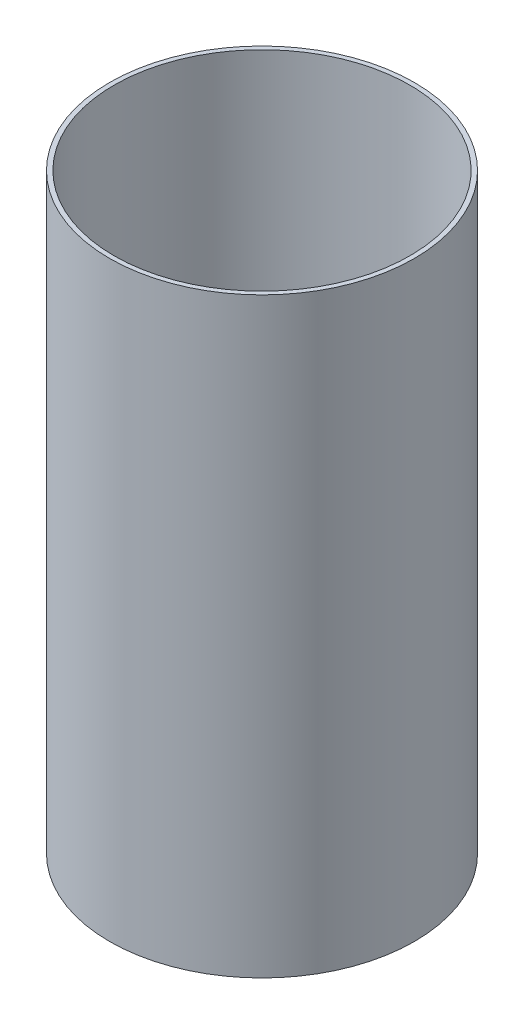
ISO-10303-21;
HEADER;
FILE_DESCRIPTION(('STEP AP214'),'2;1');
FILE_NAME('part.step','',(''),(''),'','','');
FILE_SCHEMA(('AUTOMOTIVE_DESIGN { 1 0 10303 214 1 1 1 1 }'));
ENDSEC;
DATA;
#1=APPLICATION_CONTEXT('core data for automotive mechanical design processes');
#2=APPLICATION_PROTOCOL_DEFINITION('international standard','automotive_design',2000,#1);
#3=PRODUCT_CONTEXT('',#1,'mechanical');
#4=PRODUCT('Part','Part','',(#3));
#5=PRODUCT_RELATED_PRODUCT_CATEGORY('part','',(#4));
#6=PRODUCT_DEFINITION_FORMATION('','',#4);
#7=PRODUCT_DEFINITION_CONTEXT('part definition',#1,'design');
#8=PRODUCT_DEFINITION('design','',#6,#7);
#9=PRODUCT_DEFINITION_SHAPE('','',#8);
#10=(LENGTH_UNIT() NAMED_UNIT(*) SI_UNIT(.MILLI.,.METRE.));
#11=(NAMED_UNIT(*) PLANE_ANGLE_UNIT() SI_UNIT($,.RADIAN.));
#12=(NAMED_UNIT(*) SI_UNIT($,.STERADIAN.) SOLID_ANGLE_UNIT());
#13=UNCERTAINTY_MEASURE_WITH_UNIT(LENGTH_MEASURE(1.E-05),#10,'distance_accuracy_value','');
#14=(GEOMETRIC_REPRESENTATION_CONTEXT(3) GLOBAL_UNCERTAINTY_ASSIGNED_CONTEXT((#13)) GLOBAL_UNIT_ASSIGNED_CONTEXT((#10,
#11,#12)) REPRESENTATION_CONTEXT('',''));
#15=CARTESIAN_POINT('',(0.,0.,0.));
#16=DIRECTION('',(0.,0.,1.));
#17=DIRECTION('',(1.,0.,0.));
#18=AXIS2_PLACEMENT_3D('',#15,#16,#17);
#19=CARTESIAN_POINT('',(0.,254.,0.));
#20=DIRECTION('',(0.,1.,0.));
#21=DIRECTION('',(0.,0.,1.));
#22=AXIS2_PLACEMENT_3D('',#19,#20,#21);
#23=PLANE('',#22);
#24=CARTESIAN_POINT('',(0.,254.,0.));
#25=DIRECTION('',(0.,1.,0.));
#26=DIRECTION('',(0.,0.,1.));
#27=AXIS2_PLACEMENT_3D('',#24,#25,#26);
#28=CIRCLE('',#27,65.4431);
#29=CARTESIAN_POINT('',(0.,254.,65.4431));
#30=VERTEX_POINT('',#29);
#31=EDGE_CURVE('E10',#30,#30,#28,.T.);
#32=ORIENTED_EDGE('',*,*,#31,.T.);
#33=EDGE_LOOP('',(#32));
#34=FACE_BOUND('',#33,.T.);
#35=CARTESIAN_POINT('',(0.,254.,0.));
#36=DIRECTION('',(0.,1.,0.));
#37=DIRECTION('',(0.,0.,1.));
#38=AXIS2_PLACEMENT_3D('',#35,#36,#37);
#39=CIRCLE('',#38,63.5);
#40=CARTESIAN_POINT('',(0.,254.,63.5));
#41=VERTEX_POINT('',#40);
#42=EDGE_CURVE('E41',#41,#41,#39,.T.);
#43=ORIENTED_EDGE('',*,*,#42,.F.);
#44=EDGE_LOOP('',(#43));
#45=FACE_BOUND('',#44,.T.);
#46=ADVANCED_FACE('F30',(#34,#45),#23,.T.);
#47=CARTESIAN_POINT('',(0.,0.,0.));
#48=DIRECTION('',(0.,1.,0.));
#49=DIRECTION('',(0.,0.,1.));
#50=AXIS2_PLACEMENT_3D('',#47,#48,#49);
#51=PLANE('',#50);
#52=CARTESIAN_POINT('',(0.,0.,0.));
#53=DIRECTION('',(0.,1.,0.));
#54=DIRECTION('',(0.,0.,1.));
#55=AXIS2_PLACEMENT_3D('',#52,#53,#54);
#56=CIRCLE('',#55,65.4431);
#57=CARTESIAN_POINT('',(0.,0.,65.4431));
#58=VERTEX_POINT('',#57);
#59=EDGE_CURVE('E34',#58,#58,#56,.T.);
#60=ORIENTED_EDGE('',*,*,#59,.F.);
#61=EDGE_LOOP('',(#60));
#62=FACE_BOUND('',#61,.T.);
#63=CARTESIAN_POINT('',(0.,0.,0.));
#64=DIRECTION('',(0.,1.,0.));
#65=DIRECTION('',(0.,0.,1.));
#66=AXIS2_PLACEMENT_3D('',#63,#64,#65);
#67=CIRCLE('',#66,63.5);
#68=CARTESIAN_POINT('',(0.,0.,63.5));
#69=VERTEX_POINT('',#68);
#70=EDGE_CURVE('E43',#69,#69,#67,.T.);
#71=ORIENTED_EDGE('',*,*,#70,.T.);
#72=EDGE_LOOP('',(#71));
#73=FACE_BOUND('',#72,.T.);
#74=ADVANCED_FACE('F53',(#62,#73),#51,.F.);
#75=CARTESIAN_POINT('',(0.,254.,0.));
#76=DIRECTION('',(0.,-1.,0.));
#77=DIRECTION('',(0.,0.,-1.));
#78=AXIS2_PLACEMENT_3D('',#75,#76,#77);
#79=CYLINDRICAL_SURFACE('',#78,65.4431);
#80=ORIENTED_EDGE('',*,*,#31,.F.);
#81=EDGE_LOOP('',(#80));
#82=FACE_BOUND('',#81,.T.);
#83=ORIENTED_EDGE('',*,*,#59,.T.);
#84=EDGE_LOOP('',(#83));
#85=FACE_BOUND('',#84,.T.);
#86=ADVANCED_FACE('F32',(#82,#85),#79,.T.);
#87=CARTESIAN_POINT('',(0.,254.,0.));
#88=DIRECTION('',(0.,-1.,0.));
#89=DIRECTION('',(0.,0.,-1.));
#90=AXIS2_PLACEMENT_3D('',#87,#88,#89);
#91=CYLINDRICAL_SURFACE('',#90,63.5);
#92=ORIENTED_EDGE('',*,*,#42,.T.);
#93=EDGE_LOOP('',(#92));
#94=FACE_BOUND('',#93,.T.);
#95=ORIENTED_EDGE('',*,*,#70,.F.);
#96=EDGE_LOOP('',(#95));
#97=FACE_BOUND('',#96,.T.);
#98=ADVANCED_FACE('F49',(#94,#97),#91,.F.);
#99=CLOSED_SHELL('',(#46,#74,#86,#98));
#100=MANIFOLD_SOLID_BREP('B2',#99);
#101=ADVANCED_BREP_SHAPE_REPRESENTATION('',(#18,#100),#14);
#102=SHAPE_DEFINITION_REPRESENTATION(#9,#101);
ENDSEC;
END-ISO-10303-21;
